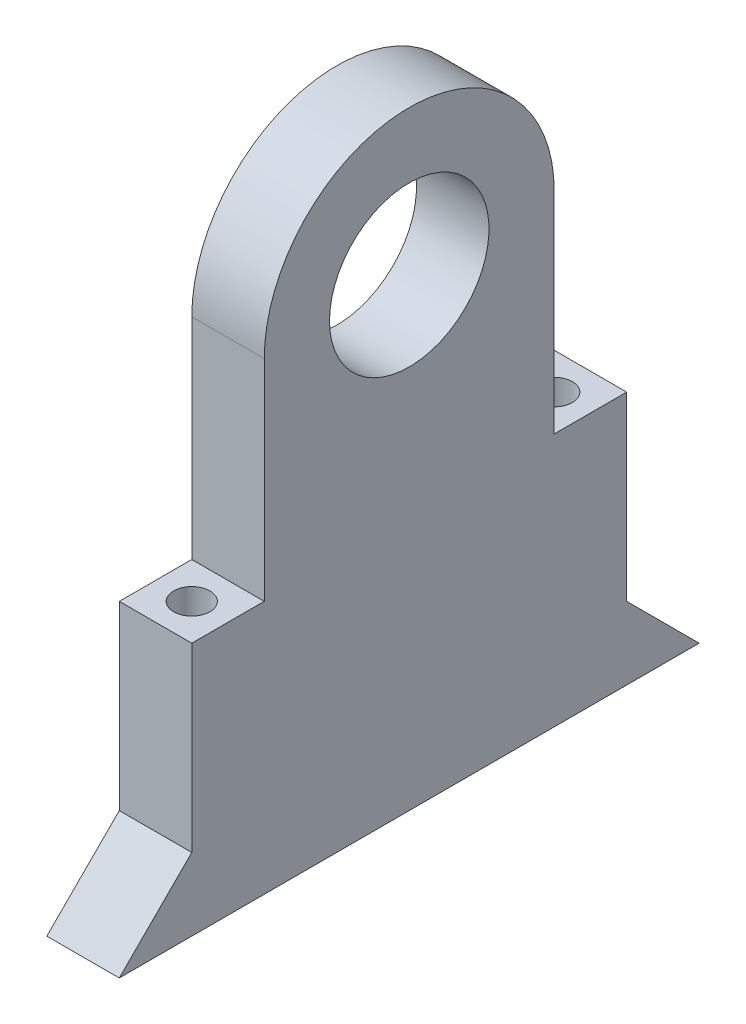
ISO-10303-21;
HEADER;
FILE_DESCRIPTION(('STEP AP214'),'2;1');
FILE_NAME('part.step','',(''),(''),'','','');
FILE_SCHEMA(('AUTOMOTIVE_DESIGN { 1 0 10303 214 1 1 1 1 }'));
ENDSEC;
DATA;
#1=APPLICATION_CONTEXT('core data for automotive mechanical design processes');
#2=APPLICATION_PROTOCOL_DEFINITION('international standard','automotive_design',2000,#1);
#3=PRODUCT_CONTEXT('',#1,'mechanical');
#4=PRODUCT('Part','Part','',(#3));
#5=PRODUCT_RELATED_PRODUCT_CATEGORY('part','',(#4));
#6=PRODUCT_DEFINITION_FORMATION('','',#4);
#7=PRODUCT_DEFINITION_CONTEXT('part definition',#1,'design');
#8=PRODUCT_DEFINITION('design','',#6,#7);
#9=PRODUCT_DEFINITION_SHAPE('','',#8);
#10=(LENGTH_UNIT() NAMED_UNIT(*) SI_UNIT(.MILLI.,.METRE.));
#11=(NAMED_UNIT(*) PLANE_ANGLE_UNIT() SI_UNIT($,.RADIAN.));
#12=(NAMED_UNIT(*) SI_UNIT($,.STERADIAN.) SOLID_ANGLE_UNIT());
#13=UNCERTAINTY_MEASURE_WITH_UNIT(LENGTH_MEASURE(1.E-05),#10,'distance_accuracy_value','');
#14=(GEOMETRIC_REPRESENTATION_CONTEXT(3) GLOBAL_UNCERTAINTY_ASSIGNED_CONTEXT((#13)) GLOBAL_UNIT_ASSIGNED_CONTEXT((#10,
#11,#12)) REPRESENTATION_CONTEXT('',''));
#15=CARTESIAN_POINT('',(0.,0.,0.));
#16=DIRECTION('',(0.,0.,1.));
#17=DIRECTION('',(1.,0.,0.));
#18=AXIS2_PLACEMENT_3D('',#15,#16,#17);
#19=CARTESIAN_POINT('',(5.,17.5,10.));
#20=DIRECTION('',(0.,0.,1.));
#21=DIRECTION('',(0.,-1.,0.));
#22=AXIS2_PLACEMENT_3D('',#19,#20,#21);
#23=PLANE('',#22);
#24=DIRECTION('',(0.,1.,0.));
#25=VECTOR('',#24,1.);
#26=CARTESIAN_POINT('',(0.,17.5,10.));
#27=LINE('',#26,#25);
#28=CARTESIAN_POINT('',(0.,17.5,10.));
#29=VERTEX_POINT('',#28);
#30=CARTESIAN_POINT('',(0.,32.,10.));
#31=VERTEX_POINT('',#30);
#32=EDGE_CURVE('E152',#29,#31,#27,.T.);
#33=ORIENTED_EDGE('',*,*,#32,.F.);
#34=DIRECTION('',(-1.,0.,0.));
#35=VECTOR('',#34,1.);
#36=CARTESIAN_POINT('',(5.,17.5,10.));
#37=LINE('',#36,#35);
#38=CARTESIAN_POINT('',(5.,17.5,10.));
#39=VERTEX_POINT('',#38);
#40=EDGE_CURVE('E11',#39,#29,#37,.T.);
#41=ORIENTED_EDGE('',*,*,#40,.F.);
#42=DIRECTION('',(0.,1.,0.));
#43=VECTOR('',#42,1.);
#44=CARTESIAN_POINT('',(5.,17.5,10.));
#45=LINE('',#44,#43);
#46=CARTESIAN_POINT('',(5.,32.,10.));
#47=VERTEX_POINT('',#46);
#48=EDGE_CURVE('E175',#39,#47,#45,.T.);
#49=ORIENTED_EDGE('',*,*,#48,.T.);
#50=DIRECTION('',(-1.,0.,0.));
#51=VECTOR('',#50,1.);
#52=CARTESIAN_POINT('',(5.,32.,10.));
#53=LINE('',#52,#51);
#54=EDGE_CURVE('E98',#47,#31,#53,.T.);
#55=ORIENTED_EDGE('',*,*,#54,.T.);
#56=EDGE_LOOP('',(#33,#41,#49,#55));
#57=FACE_BOUND('',#56,.T.);
#58=ADVANCED_FACE('F37',(#57),#23,.T.);
#59=CARTESIAN_POINT('',(5.,17.5,10.));
#60=DIRECTION('',(0.,-1.,0.));
#61=DIRECTION('',(0.,0.,-1.));
#62=AXIS2_PLACEMENT_3D('',#59,#60,#61);
#63=PLANE('',#62);
#64=CARTESIAN_POINT('',(2.5,17.5,12.5000000000001));
#65=DIRECTION('',(0.,1.,0.));
#66=DIRECTION('',(0.,0.,1.));
#67=AXIS2_PLACEMENT_3D('',#64,#65,#66);
#68=CIRCLE('',#67,1.24999999999999);
#69=CARTESIAN_POINT('',(2.5,17.5,13.7500000000001));
#70=VERTEX_POINT('',#69);
#71=EDGE_CURVE('E277',#70,#70,#68,.T.);
#72=ORIENTED_EDGE('',*,*,#71,.F.);
#73=EDGE_LOOP('',(#72));
#74=FACE_BOUND('',#73,.T.);
#75=DIRECTION('',(0.,0.,1.));
#76=VECTOR('',#75,1.);
#77=CARTESIAN_POINT('',(0.,17.5,10.));
#78=LINE('',#77,#76);
#79=CARTESIAN_POINT('',(0.,17.5,15.0000000000001));
#80=VERTEX_POINT('',#79);
#81=EDGE_CURVE('E89',#29,#80,#78,.T.);
#82=ORIENTED_EDGE('',*,*,#81,.T.);
#83=DIRECTION('',(-1.,0.,0.));
#84=VECTOR('',#83,1.);
#85=CARTESIAN_POINT('',(5.,17.5,15.0000000000001));
#86=LINE('',#85,#84);
#87=CARTESIAN_POINT('',(5.,17.5,15.0000000000001));
#88=VERTEX_POINT('',#87);
#89=EDGE_CURVE('E46',#88,#80,#86,.T.);
#90=ORIENTED_EDGE('',*,*,#89,.F.);
#91=DIRECTION('',(0.,0.,1.));
#92=VECTOR('',#91,1.);
#93=CARTESIAN_POINT('',(5.,17.5,10.));
#94=LINE('',#93,#92);
#95=EDGE_CURVE('E131',#39,#88,#94,.T.);
#96=ORIENTED_EDGE('',*,*,#95,.F.);
#97=ORIENTED_EDGE('',*,*,#40,.T.);
#98=EDGE_LOOP('',(#82,#90,#96,#97));
#99=FACE_BOUND('',#98,.T.);
#100=ADVANCED_FACE('F247',(#74,#99),#63,.F.);
#101=CARTESIAN_POINT('',(5.,17.5,15.0000000000001));
#102=DIRECTION('',(0.,0.,-1.));
#103=DIRECTION('',(-1.,0.,0.));
#104=AXIS2_PLACEMENT_3D('',#101,#102,#103);
#105=PLANE('',#104);
#106=DIRECTION('',(0.,-1.,0.));
#107=VECTOR('',#106,1.);
#108=CARTESIAN_POINT('',(0.,17.5,15.0000000000001));
#109=LINE('',#108,#107);
#110=CARTESIAN_POINT('',(0.,5.00000000000003,15.0000000000001));
#111=VERTEX_POINT('',#110);
#112=EDGE_CURVE('E138',#80,#111,#109,.T.);
#113=ORIENTED_EDGE('',*,*,#112,.T.);
#114=DIRECTION('',(-1.,0.,0.));
#115=VECTOR('',#114,1.);
#116=CARTESIAN_POINT('',(5.,5.00000000000003,15.0000000000001));
#117=LINE('',#116,#115);
#118=CARTESIAN_POINT('',(5.,5.00000000000003,15.0000000000001));
#119=VERTEX_POINT('',#118);
#120=EDGE_CURVE('E135',#119,#111,#117,.T.);
#121=ORIENTED_EDGE('',*,*,#120,.F.);
#122=DIRECTION('',(0.,-1.,0.));
#123=VECTOR('',#122,1.);
#124=CARTESIAN_POINT('',(5.,10.,15.0000000000001));
#125=LINE('',#124,#123);
#126=EDGE_CURVE('E123',#88,#119,#125,.T.);
#127=ORIENTED_EDGE('',*,*,#126,.F.);
#128=ORIENTED_EDGE('',*,*,#89,.T.);
#129=EDGE_LOOP('',(#113,#121,#127,#128));
#130=FACE_BOUND('',#129,.T.);
#131=ADVANCED_FACE('F136',(#130),#105,.F.);
#132=CARTESIAN_POINT('',(5.,5.00000000000003,15.0000000000001));
#133=DIRECTION('',(0.,-0.70710678118652,-0.707106781186575));
#134=DIRECTION('',(0.,0.707106781186575,-0.70710678118652));
#135=AXIS2_PLACEMENT_3D('',#132,#133,#134);
#136=PLANE('',#135);
#137=DIRECTION('',(0.,-0.707106781186575,0.70710678118652));
#138=VECTOR('',#137,1.);
#139=CARTESIAN_POINT('',(0.,5.00000000000003,15.0000000000001));
#140=LINE('',#139,#138);
#141=CARTESIAN_POINT('',(0.,0.,19.9999999999998));
#142=VERTEX_POINT('',#141);
#143=EDGE_CURVE('E172',#111,#142,#140,.T.);
#144=ORIENTED_EDGE('',*,*,#143,.T.);
#145=DIRECTION('',(-1.,0.,0.));
#146=VECTOR('',#145,1.);
#147=CARTESIAN_POINT('',(5.,0.,19.9999999999998));
#148=LINE('',#147,#146);
#149=CARTESIAN_POINT('',(5.,0.,19.9999999999998));
#150=VERTEX_POINT('',#149);
#151=EDGE_CURVE('E141',#150,#142,#148,.T.);
#152=ORIENTED_EDGE('',*,*,#151,.F.);
#153=DIRECTION('',(0.,-0.707106781186575,0.70710678118652));
#154=VECTOR('',#153,1.);
#155=CARTESIAN_POINT('',(5.,5.00000000000003,15.0000000000001));
#156=LINE('',#155,#154);
#157=EDGE_CURVE('E129',#119,#150,#156,.T.);
#158=ORIENTED_EDGE('',*,*,#157,.F.);
#159=ORIENTED_EDGE('',*,*,#120,.T.);
#160=EDGE_LOOP('',(#144,#152,#158,#159));
#161=FACE_BOUND('',#160,.T.);
#162=ADVANCED_FACE('F143',(#161),#136,.F.);
#163=CARTESIAN_POINT('',(5.,0.,19.9999999999998));
#164=DIRECTION('',(0.,1.,0.));
#165=DIRECTION('',(0.,0.,1.));
#166=AXIS2_PLACEMENT_3D('',#163,#164,#165);
#167=PLANE('',#166);
#168=CARTESIAN_POINT('',(2.5,0.,8.));
#169=DIRECTION('',(0.,-1.,0.));
#170=DIRECTION('',(0.,0.,-1.));
#171=AXIS2_PLACEMENT_3D('',#168,#169,#170);
#172=CIRCLE('',#171,1.24999999999999);
#173=CARTESIAN_POINT('',(2.5,0.,6.75000000000001));
#174=VERTEX_POINT('',#173);
#175=EDGE_CURVE('E296',#174,#174,#172,.T.);
#176=ORIENTED_EDGE('',*,*,#175,.F.);
#177=EDGE_LOOP('',(#176));
#178=FACE_BOUND('',#177,.T.);
#179=CARTESIAN_POINT('',(2.5,0.,0.));
#180=DIRECTION('',(0.,-1.,0.));
#181=DIRECTION('',(0.,0.,-1.));
#182=AXIS2_PLACEMENT_3D('',#179,#180,#181);
#183=CIRCLE('',#182,1.24999999999999);
#184=CARTESIAN_POINT('',(2.5,0.,-1.24999999999999));
#185=VERTEX_POINT('',#184);
#186=EDGE_CURVE('E290',#185,#185,#183,.T.);
#187=ORIENTED_EDGE('',*,*,#186,.F.);
#188=EDGE_LOOP('',(#187));
#189=FACE_BOUND('',#188,.T.);
#190=CARTESIAN_POINT('',(2.5,0.,-8.));
#191=DIRECTION('',(0.,-1.,0.));
#192=DIRECTION('',(0.,0.,-1.));
#193=AXIS2_PLACEMENT_3D('',#190,#191,#192);
#194=CIRCLE('',#193,1.24999999999999);
#195=CARTESIAN_POINT('',(2.5,0.,-9.24999999999999));
#196=VERTEX_POINT('',#195);
#197=EDGE_CURVE('E284',#196,#196,#194,.T.);
#198=ORIENTED_EDGE('',*,*,#197,.F.);
#199=EDGE_LOOP('',(#198));
#200=FACE_BOUND('',#199,.T.);
#201=CARTESIAN_POINT('',(2.5,0.,12.5000000000001));
#202=DIRECTION('',(0.,1.,0.));
#203=DIRECTION('',(0.,0.,1.));
#204=AXIS2_PLACEMENT_3D('',#201,#202,#203);
#205=CIRCLE('',#204,1.24999999999999);
#206=CARTESIAN_POINT('',(2.5,0.,13.7500000000001));
#207=VERTEX_POINT('',#206);
#208=EDGE_CURVE('E40',#207,#207,#205,.T.);
#209=ORIENTED_EDGE('',*,*,#208,.T.);
#210=EDGE_LOOP('',(#209));
#211=FACE_BOUND('',#210,.T.);
#212=CARTESIAN_POINT('',(2.5,0.,-12.5000000000001));
#213=DIRECTION('',(0.,1.,0.));
#214=DIRECTION('',(0.,0.,1.));
#215=AXIS2_PLACEMENT_3D('',#212,#213,#214);
#216=CIRCLE('',#215,1.24999999999999);
#217=CARTESIAN_POINT('',(2.5,0.,-11.2500000000001));
#218=VERTEX_POINT('',#217);
#219=EDGE_CURVE('E197',#218,#218,#216,.T.);
#220=ORIENTED_EDGE('',*,*,#219,.T.);
#221=EDGE_LOOP('',(#220));
#222=FACE_BOUND('',#221,.T.);
#223=DIRECTION('',(0.,0.,-1.));
#224=VECTOR('',#223,1.);
#225=CARTESIAN_POINT('',(0.,0.,19.9999999999998));
#226=LINE('',#225,#224);
#227=CARTESIAN_POINT('',(0.,0.,-19.9999999999998));
#228=VERTEX_POINT('',#227);
#229=EDGE_CURVE('E170',#142,#228,#226,.T.);
#230=ORIENTED_EDGE('',*,*,#229,.T.);
#231=DIRECTION('',(-1.,0.,0.));
#232=VECTOR('',#231,1.);
#233=CARTESIAN_POINT('',(5.,0.,-19.9999999999998));
#234=LINE('',#233,#232);
#235=CARTESIAN_POINT('',(5.,0.,-19.9999999999998));
#236=VERTEX_POINT('',#235);
#237=EDGE_CURVE('E179',#236,#228,#234,.T.);
#238=ORIENTED_EDGE('',*,*,#237,.F.);
#239=DIRECTION('',(0.,0.,1.));
#240=VECTOR('',#239,1.);
#241=CARTESIAN_POINT('',(5.,0.,-19.9999999999998));
#242=LINE('',#241,#240);
#243=EDGE_CURVE('E145',#236,#150,#242,.T.);
#244=ORIENTED_EDGE('',*,*,#243,.T.);
#245=ORIENTED_EDGE('',*,*,#151,.T.);
#246=EDGE_LOOP('',(#230,#238,#244,#245));
#247=FACE_BOUND('',#246,.T.);
#248=ADVANCED_FACE('F222',(#178,#189,#200,#211,#222,#247),#167,.F.);
#249=CARTESIAN_POINT('',(5.,5.,-15.0000000000001));
#250=DIRECTION('',(0.,0.707106781186522,-0.707106781186573));
#251=DIRECTION('',(0.,0.707106781186573,0.707106781186522));
#252=AXIS2_PLACEMENT_3D('',#249,#250,#251);
#253=PLANE('',#252);
#254=DIRECTION('',(0.,-0.707106781186573,-0.707106781186522));
#255=VECTOR('',#254,1.);
#256=CARTESIAN_POINT('',(0.,5.,-15.0000000000001));
#257=LINE('',#256,#255);
#258=CARTESIAN_POINT('',(0.,5.,-15.0000000000001));
#259=VERTEX_POINT('',#258);
#260=EDGE_CURVE('E167',#259,#228,#257,.T.);
#261=ORIENTED_EDGE('',*,*,#260,.F.);
#262=DIRECTION('',(-1.,0.,0.));
#263=VECTOR('',#262,1.);
#264=CARTESIAN_POINT('',(5.,5.,-15.0000000000001));
#265=LINE('',#264,#263);
#266=CARTESIAN_POINT('',(5.,5.,-15.0000000000001));
#267=VERTEX_POINT('',#266);
#268=EDGE_CURVE('E182',#267,#259,#265,.T.);
#269=ORIENTED_EDGE('',*,*,#268,.F.);
#270=DIRECTION('',(0.,-0.707106781186573,-0.707106781186522));
#271=VECTOR('',#270,1.);
#272=CARTESIAN_POINT('',(5.,5.,-15.0000000000001));
#273=LINE('',#272,#271);
#274=EDGE_CURVE('E147',#267,#236,#273,.T.);
#275=ORIENTED_EDGE('',*,*,#274,.T.);
#276=ORIENTED_EDGE('',*,*,#237,.T.);
#277=EDGE_LOOP('',(#261,#269,#275,#276));
#278=FACE_BOUND('',#277,.T.);
#279=ADVANCED_FACE('F219',(#278),#253,.T.);
#280=CARTESIAN_POINT('',(5.,10.,-15.0000000000001));
#281=DIRECTION('',(0.,0.,-1.));
#282=DIRECTION('',(0.,1.,0.));
#283=AXIS2_PLACEMENT_3D('',#280,#281,#282);
#284=PLANE('',#283);
#285=DIRECTION('',(0.,-1.,0.));
#286=VECTOR('',#285,1.);
#287=CARTESIAN_POINT('',(0.,10.,-15.0000000000001));
#288=LINE('',#287,#286);
#289=CARTESIAN_POINT('',(0.,17.5,-15.));
#290=VERTEX_POINT('',#289);
#291=EDGE_CURVE('E164',#290,#259,#288,.T.);
#292=ORIENTED_EDGE('',*,*,#291,.F.);
#293=DIRECTION('',(-1.,0.,0.));
#294=VECTOR('',#293,1.);
#295=CARTESIAN_POINT('',(5.,17.5,-15.));
#296=LINE('',#295,#294);
#297=CARTESIAN_POINT('',(5.,17.5,-15.));
#298=VERTEX_POINT('',#297);
#299=EDGE_CURVE('E184',#298,#290,#296,.T.);
#300=ORIENTED_EDGE('',*,*,#299,.F.);
#301=DIRECTION('',(0.,1.,0.));
#302=VECTOR('',#301,1.);
#303=CARTESIAN_POINT('',(5.,10.,-15.0000000000001));
#304=LINE('',#303,#302);
#305=EDGE_CURVE('E213',#267,#298,#304,.T.);
#306=ORIENTED_EDGE('',*,*,#305,.F.);
#307=ORIENTED_EDGE('',*,*,#268,.T.);
#308=EDGE_LOOP('',(#292,#300,#306,#307));
#309=FACE_BOUND('',#308,.T.);
#310=ADVANCED_FACE('F229',(#309),#284,.T.);
#311=CARTESIAN_POINT('',(5.,17.5,-15.));
#312=DIRECTION('',(0.,-1.,0.));
#313=DIRECTION('',(0.,0.,-1.));
#314=AXIS2_PLACEMENT_3D('',#311,#312,#313);
#315=PLANE('',#314);
#316=CARTESIAN_POINT('',(2.5,17.5,-12.5000000000001));
#317=DIRECTION('',(0.,1.,0.));
#318=DIRECTION('',(0.,0.,1.));
#319=AXIS2_PLACEMENT_3D('',#316,#317,#318);
#320=CIRCLE('',#319,1.24999999999999);
#321=CARTESIAN_POINT('',(2.5,17.5,-11.2500000000001));
#322=VERTEX_POINT('',#321);
#323=EDGE_CURVE('E202',#322,#322,#320,.T.);
#324=ORIENTED_EDGE('',*,*,#323,.F.);
#325=EDGE_LOOP('',(#324));
#326=FACE_BOUND('',#325,.T.);
#327=DIRECTION('',(0.,0.,1.));
#328=VECTOR('',#327,1.);
#329=CARTESIAN_POINT('',(0.,17.5,-15.));
#330=LINE('',#329,#328);
#331=CARTESIAN_POINT('',(0.,17.5,-10.));
#332=VERTEX_POINT('',#331);
#333=EDGE_CURVE('E162',#290,#332,#330,.T.);
#334=ORIENTED_EDGE('',*,*,#333,.T.);
#335=DIRECTION('',(-1.,0.,0.));
#336=VECTOR('',#335,1.);
#337=CARTESIAN_POINT('',(5.,17.5,-10.));
#338=LINE('',#337,#336);
#339=CARTESIAN_POINT('',(5.,17.5,-10.));
#340=VERTEX_POINT('',#339);
#341=EDGE_CURVE('E187',#340,#332,#338,.T.);
#342=ORIENTED_EDGE('',*,*,#341,.F.);
#343=DIRECTION('',(0.,0.,1.));
#344=VECTOR('',#343,1.);
#345=CARTESIAN_POINT('',(5.,17.5,-15.));
#346=LINE('',#345,#344);
#347=EDGE_CURVE('E211',#298,#340,#346,.T.);
#348=ORIENTED_EDGE('',*,*,#347,.F.);
#349=ORIENTED_EDGE('',*,*,#299,.T.);
#350=EDGE_LOOP('',(#334,#342,#348,#349));
#351=FACE_BOUND('',#350,.T.);
#352=ADVANCED_FACE('F232',(#326,#351),#315,.F.);
#353=CARTESIAN_POINT('',(5.,17.5,-10.));
#354=DIRECTION('',(0.,0.,1.));
#355=DIRECTION('',(0.,-1.,0.));
#356=AXIS2_PLACEMENT_3D('',#353,#354,#355);
#357=PLANE('',#356);
#358=DIRECTION('',(0.,1.,0.));
#359=VECTOR('',#358,1.);
#360=CARTESIAN_POINT('',(0.,17.5,-10.));
#361=LINE('',#360,#359);
#362=CARTESIAN_POINT('',(0.,32.,-9.99999999999999));
#363=VERTEX_POINT('',#362);
#364=EDGE_CURVE('E159',#332,#363,#361,.T.);
#365=ORIENTED_EDGE('',*,*,#364,.T.);
#366=DIRECTION('',(-1.,0.,0.));
#367=VECTOR('',#366,1.);
#368=CARTESIAN_POINT('',(5.,32.,-9.99999999999999));
#369=LINE('',#368,#367);
#370=CARTESIAN_POINT('',(5.,32.,-9.99999999999999));
#371=VERTEX_POINT('',#370);
#372=EDGE_CURVE('E190',#371,#363,#369,.T.);
#373=ORIENTED_EDGE('',*,*,#372,.F.);
#374=DIRECTION('',(0.,1.,0.));
#375=VECTOR('',#374,1.);
#376=CARTESIAN_POINT('',(5.,17.5,-10.));
#377=LINE('',#376,#375);
#378=EDGE_CURVE('E209',#340,#371,#377,.T.);
#379=ORIENTED_EDGE('',*,*,#378,.F.);
#380=ORIENTED_EDGE('',*,*,#341,.T.);
#381=EDGE_LOOP('',(#365,#373,#379,#380));
#382=FACE_BOUND('',#381,.T.);
#383=ADVANCED_FACE('F237',(#382),#357,.F.);
#384=CARTESIAN_POINT('',(5.,32.,0.));
#385=DIRECTION('',(-1.,0.,0.));
#386=DIRECTION('',(0.,0.,1.));
#387=AXIS2_PLACEMENT_3D('',#384,#385,#386);
#388=CYLINDRICAL_SURFACE('',#387,10.);
#389=CARTESIAN_POINT('',(0.,32.,0.));
#390=DIRECTION('',(-1.,0.,0.));
#391=DIRECTION('',(0.,0.,1.));
#392=AXIS2_PLACEMENT_3D('',#389,#390,#391);
#393=CIRCLE('',#392,10.);
#394=EDGE_CURVE('E155',#31,#363,#393,.T.);
#395=ORIENTED_EDGE('',*,*,#394,.F.);
#396=ORIENTED_EDGE('',*,*,#54,.F.);
#397=CARTESIAN_POINT('',(5.,32.,0.));
#398=DIRECTION('',(-1.,0.,0.));
#399=DIRECTION('',(0.,0.,1.));
#400=AXIS2_PLACEMENT_3D('',#397,#398,#399);
#401=CIRCLE('',#400,10.);
#402=EDGE_CURVE('E207',#47,#371,#401,.T.);
#403=ORIENTED_EDGE('',*,*,#402,.T.);
#404=ORIENTED_EDGE('',*,*,#372,.T.);
#405=EDGE_LOOP('',(#395,#396,#403,#404));
#406=FACE_BOUND('',#405,.T.);
#407=ADVANCED_FACE('F238',(#406),#388,.T.);
#408=CARTESIAN_POINT('',(5.,32.,0.));
#409=DIRECTION('',(-1.,0.,0.));
#410=DIRECTION('',(0.,0.,1.));
#411=AXIS2_PLACEMENT_3D('',#408,#409,#410);
#412=PLANE('',#411);
#413=CARTESIAN_POINT('',(5.,32.,0.));
#414=DIRECTION('',(-1.,0.,0.));
#415=DIRECTION('',(0.,0.,1.));
#416=AXIS2_PLACEMENT_3D('',#413,#414,#415);
#417=CIRCLE('',#416,5.49999999999999);
#418=CARTESIAN_POINT('',(5.,32.,5.5));
#419=VERTEX_POINT('',#418);
#420=EDGE_CURVE('E156',#419,#419,#417,.T.);
#421=ORIENTED_EDGE('',*,*,#420,.T.);
#422=EDGE_LOOP('',(#421));
#423=FACE_BOUND('',#422,.T.);
#424=ORIENTED_EDGE('',*,*,#48,.F.);
#425=ORIENTED_EDGE('',*,*,#95,.T.);
#426=ORIENTED_EDGE('',*,*,#126,.T.);
#427=ORIENTED_EDGE('',*,*,#157,.T.);
#428=ORIENTED_EDGE('',*,*,#243,.F.);
#429=ORIENTED_EDGE('',*,*,#274,.F.);
#430=ORIENTED_EDGE('',*,*,#305,.T.);
#431=ORIENTED_EDGE('',*,*,#347,.T.);
#432=ORIENTED_EDGE('',*,*,#378,.T.);
#433=ORIENTED_EDGE('',*,*,#402,.F.);
#434=EDGE_LOOP('',(#424,#425,#426,#427,#428,#429,#430,#431,#432,#433));
#435=FACE_BOUND('',#434,.T.);
#436=ADVANCED_FACE('F126',(#423,#435),#412,.F.);
#437=CARTESIAN_POINT('',(0.,32.,0.));
#438=DIRECTION('',(-1.,0.,0.));
#439=DIRECTION('',(0.,0.,1.));
#440=AXIS2_PLACEMENT_3D('',#437,#438,#439);
#441=PLANE('',#440);
#442=CARTESIAN_POINT('',(0.,32.,0.));
#443=DIRECTION('',(-1.,0.,0.));
#444=DIRECTION('',(0.,0.,1.));
#445=AXIS2_PLACEMENT_3D('',#442,#443,#444);
#446=CIRCLE('',#445,5.5);
#447=CARTESIAN_POINT('',(0.,32.,5.5));
#448=VERTEX_POINT('',#447);
#449=EDGE_CURVE('E193',#448,#448,#446,.T.);
#450=ORIENTED_EDGE('',*,*,#449,.F.);
#451=EDGE_LOOP('',(#450));
#452=FACE_BOUND('',#451,.T.);
#453=ORIENTED_EDGE('',*,*,#32,.T.);
#454=ORIENTED_EDGE('',*,*,#394,.T.);
#455=ORIENTED_EDGE('',*,*,#364,.F.);
#456=ORIENTED_EDGE('',*,*,#333,.F.);
#457=ORIENTED_EDGE('',*,*,#291,.T.);
#458=ORIENTED_EDGE('',*,*,#260,.T.);
#459=ORIENTED_EDGE('',*,*,#229,.F.);
#460=ORIENTED_EDGE('',*,*,#143,.F.);
#461=ORIENTED_EDGE('',*,*,#112,.F.);
#462=ORIENTED_EDGE('',*,*,#81,.F.);
#463=EDGE_LOOP('',(#453,#454,#455,#456,#457,#458,#459,#460,#461,#462));
#464=FACE_BOUND('',#463,.T.);
#465=ADVANCED_FACE('F225',(#452,#464),#441,.T.);
#466=CARTESIAN_POINT('',(0.,32.,0.));
#467=DIRECTION('',(-1.,0.,0.));
#468=DIRECTION('',(0.,0.,1.));
#469=AXIS2_PLACEMENT_3D('',#466,#467,#468);
#470=CYLINDRICAL_SURFACE('',#469,5.49999999999999);
#471=ORIENTED_EDGE('',*,*,#449,.T.);
#472=EDGE_LOOP('',(#471));
#473=FACE_BOUND('',#472,.T.);
#474=ORIENTED_EDGE('',*,*,#420,.F.);
#475=EDGE_LOOP('',(#474));
#476=FACE_BOUND('',#475,.T.);
#477=ADVANCED_FACE('F313',(#473,#476),#470,.F.);
#478=CARTESIAN_POINT('',(2.5,17.5,-12.5000000000001));
#479=DIRECTION('',(0.,1.,0.));
#480=DIRECTION('',(0.,0.,1.));
#481=AXIS2_PLACEMENT_3D('',#478,#479,#480);
#482=CYLINDRICAL_SURFACE('',#481,1.24999999999999);
#483=ORIENTED_EDGE('',*,*,#323,.T.);
#484=EDGE_LOOP('',(#483));
#485=FACE_BOUND('',#484,.T.);
#486=ORIENTED_EDGE('',*,*,#219,.F.);
#487=EDGE_LOOP('',(#486));
#488=FACE_BOUND('',#487,.T.);
#489=ADVANCED_FACE('F310',(#485,#488),#482,.F.);
#490=CARTESIAN_POINT('',(2.5,17.5,12.5000000000001));
#491=DIRECTION('',(0.,1.,0.));
#492=DIRECTION('',(0.,0.,1.));
#493=AXIS2_PLACEMENT_3D('',#490,#491,#492);
#494=CYLINDRICAL_SURFACE('',#493,1.24999999999999);
#495=ORIENTED_EDGE('',*,*,#71,.T.);
#496=EDGE_LOOP('',(#495));
#497=FACE_BOUND('',#496,.T.);
#498=ORIENTED_EDGE('',*,*,#208,.F.);
#499=EDGE_LOOP('',(#498));
#500=FACE_BOUND('',#499,.T.);
#501=ADVANCED_FACE('F312',(#497,#500),#494,.F.);
#502=CARTESIAN_POINT('',(2.5,7.99999999999999,-8.));
#503=DIRECTION('',(0.,-1.,0.));
#504=DIRECTION('',(0.,0.,-1.));
#505=AXIS2_PLACEMENT_3D('',#502,#503,#504);
#506=CONICAL_SURFACE('',#505,1.24999999999999,1.02974425867664);
#507=CARTESIAN_POINT('',(2.5,8.75107577378445,-8.));
#508=VERTEX_POINT('',#507);
#509=VERTEX_LOOP('',#508);
#510=FACE_BOUND('',#509,.T.);
#511=CARTESIAN_POINT('',(2.5,7.99999999999999,-8.));
#512=DIRECTION('',(0.,-1.,0.));
#513=DIRECTION('',(0.,0.,-1.));
#514=AXIS2_PLACEMENT_3D('',#511,#512,#513);
#515=CIRCLE('',#514,1.24999999999999);
#516=CARTESIAN_POINT('',(2.5,7.99999999999999,-9.24999999999999));
#517=VERTEX_POINT('',#516);
#518=EDGE_CURVE('E281',#517,#517,#515,.T.);
#519=ORIENTED_EDGE('',*,*,#518,.T.);
#520=EDGE_LOOP('',(#519));
#521=FACE_BOUND('',#520,.T.);
#522=ADVANCED_FACE('F319',(#510,#521),#506,.F.);
#523=CARTESIAN_POINT('',(2.5,0.,-8.));
#524=DIRECTION('',(0.,-1.,0.));
#525=DIRECTION('',(0.,0.,-1.));
#526=AXIS2_PLACEMENT_3D('',#523,#524,#525);
#527=CYLINDRICAL_SURFACE('',#526,1.24999999999999);
#528=ORIENTED_EDGE('',*,*,#518,.F.);
#529=EDGE_LOOP('',(#528));
#530=FACE_BOUND('',#529,.T.);
#531=ORIENTED_EDGE('',*,*,#197,.T.);
#532=EDGE_LOOP('',(#531));
#533=FACE_BOUND('',#532,.T.);
#534=ADVANCED_FACE('F326',(#530,#533),#527,.F.);
#535=CARTESIAN_POINT('',(2.5,7.99999999999999,0.));
#536=DIRECTION('',(0.,-1.,0.));
#537=DIRECTION('',(0.,0.,-1.));
#538=AXIS2_PLACEMENT_3D('',#535,#536,#537);
#539=CONICAL_SURFACE('',#538,1.24999999999999,1.02974425867664);
#540=CARTESIAN_POINT('',(2.5,8.75107577378445,0.));
#541=VERTEX_POINT('',#540);
#542=VERTEX_LOOP('',#541);
#543=FACE_BOUND('',#542,.T.);
#544=CARTESIAN_POINT('',(2.5,7.99999999999999,0.));
#545=DIRECTION('',(0.,-1.,0.));
#546=DIRECTION('',(0.,0.,-1.));
#547=AXIS2_PLACEMENT_3D('',#544,#545,#546);
#548=CIRCLE('',#547,1.24999999999999);
#549=CARTESIAN_POINT('',(2.5,7.99999999999999,-1.24999999999999));
#550=VERTEX_POINT('',#549);
#551=EDGE_CURVE('E287',#550,#550,#548,.T.);
#552=ORIENTED_EDGE('',*,*,#551,.T.);
#553=EDGE_LOOP('',(#552));
#554=FACE_BOUND('',#553,.T.);
#555=ADVANCED_FACE('F330',(#543,#554),#539,.F.);
#556=CARTESIAN_POINT('',(2.5,0.,0.));
#557=DIRECTION('',(0.,-1.,0.));
#558=DIRECTION('',(0.,0.,-1.));
#559=AXIS2_PLACEMENT_3D('',#556,#557,#558);
#560=CYLINDRICAL_SURFACE('',#559,1.24999999999999);
#561=ORIENTED_EDGE('',*,*,#551,.F.);
#562=EDGE_LOOP('',(#561));
#563=FACE_BOUND('',#562,.T.);
#564=ORIENTED_EDGE('',*,*,#186,.T.);
#565=EDGE_LOOP('',(#564));
#566=FACE_BOUND('',#565,.T.);
#567=ADVANCED_FACE('F334',(#563,#566),#560,.F.);
#568=CARTESIAN_POINT('',(2.5,7.99999999999999,8.));
#569=DIRECTION('',(0.,-1.,0.));
#570=DIRECTION('',(0.,0.,-1.));
#571=AXIS2_PLACEMENT_3D('',#568,#569,#570);
#572=CONICAL_SURFACE('',#571,1.24999999999999,1.02974425867664);
#573=CARTESIAN_POINT('',(2.5,8.75107577378445,8.));
#574=VERTEX_POINT('',#573);
#575=VERTEX_LOOP('',#574);
#576=FACE_BOUND('',#575,.T.);
#577=CARTESIAN_POINT('',(2.5,7.99999999999999,8.));
#578=DIRECTION('',(0.,-1.,0.));
#579=DIRECTION('',(0.,0.,-1.));
#580=AXIS2_PLACEMENT_3D('',#577,#578,#579);
#581=CIRCLE('',#580,1.24999999999999);
#582=CARTESIAN_POINT('',(2.5,7.99999999999999,6.75000000000001));
#583=VERTEX_POINT('',#582);
#584=EDGE_CURVE('E293',#583,#583,#581,.T.);
#585=ORIENTED_EDGE('',*,*,#584,.T.);
#586=EDGE_LOOP('',(#585));
#587=FACE_BOUND('',#586,.T.);
#588=ADVANCED_FACE('F338',(#576,#587),#572,.F.);
#589=CARTESIAN_POINT('',(2.5,0.,8.));
#590=DIRECTION('',(0.,-1.,0.));
#591=DIRECTION('',(0.,0.,-1.));
#592=AXIS2_PLACEMENT_3D('',#589,#590,#591);
#593=CYLINDRICAL_SURFACE('',#592,1.24999999999999);
#594=ORIENTED_EDGE('',*,*,#584,.F.);
#595=EDGE_LOOP('',(#594));
#596=FACE_BOUND('',#595,.T.);
#597=ORIENTED_EDGE('',*,*,#175,.T.);
#598=EDGE_LOOP('',(#597));
#599=FACE_BOUND('',#598,.T.);
#600=ADVANCED_FACE('F300',(#596,#599),#593,.F.);
#601=CLOSED_SHELL('',(#58,#100,#131,#162,#248,#279,#310,#352,#383,#407,#436,#465,#477,#489,#501,
#522,#534,#555,#567,#588,#600));
#602=MANIFOLD_SOLID_BREP('B2',#601);
#603=ADVANCED_BREP_SHAPE_REPRESENTATION('',(#18,#602),#14);
#604=SHAPE_DEFINITION_REPRESENTATION(#9,#603);
ENDSEC;
END-ISO-10303-21;
